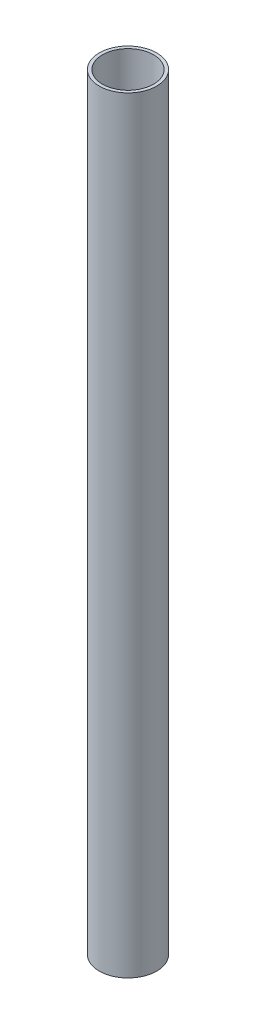
ISO-10303-21;
HEADER;
FILE_DESCRIPTION(('STEP AP214'),'2;1');
FILE_NAME('part.step','',(''),(''),'','','');
FILE_SCHEMA(('AUTOMOTIVE_DESIGN { 1 0 10303 214 1 1 1 1 }'));
ENDSEC;
DATA;
#1=APPLICATION_CONTEXT('core data for automotive mechanical design processes');
#2=APPLICATION_PROTOCOL_DEFINITION('international standard','automotive_design',2000,#1);
#3=PRODUCT_CONTEXT('',#1,'mechanical');
#4=PRODUCT('Part','Part','',(#3));
#5=PRODUCT_RELATED_PRODUCT_CATEGORY('part','',(#4));
#6=PRODUCT_DEFINITION_FORMATION('','',#4);
#7=PRODUCT_DEFINITION_CONTEXT('part definition',#1,'design');
#8=PRODUCT_DEFINITION('design','',#6,#7);
#9=PRODUCT_DEFINITION_SHAPE('','',#8);
#10=(LENGTH_UNIT() NAMED_UNIT(*) SI_UNIT(.MILLI.,.METRE.));
#11=(NAMED_UNIT(*) PLANE_ANGLE_UNIT() SI_UNIT($,.RADIAN.));
#12=(NAMED_UNIT(*) SI_UNIT($,.STERADIAN.) SOLID_ANGLE_UNIT());
#13=UNCERTAINTY_MEASURE_WITH_UNIT(LENGTH_MEASURE(1.E-05),#10,'distance_accuracy_value','');
#14=(GEOMETRIC_REPRESENTATION_CONTEXT(3) GLOBAL_UNCERTAINTY_ASSIGNED_CONTEXT((#13)) GLOBAL_UNIT_ASSIGNED_CONTEXT((#10,
#11,#12)) REPRESENTATION_CONTEXT('',''));
#15=CARTESIAN_POINT('',(0.,0.,0.));
#16=DIRECTION('',(0.,0.,1.));
#17=DIRECTION('',(1.,0.,0.));
#18=AXIS2_PLACEMENT_3D('',#15,#16,#17);
#19=CARTESIAN_POINT('',(0.,1524.,0.));
#20=DIRECTION('',(0.,1.,0.));
#21=DIRECTION('',(0.,0.,1.));
#22=AXIS2_PLACEMENT_3D('',#19,#20,#21);
#23=PLANE('',#22);
#24=CARTESIAN_POINT('',(0.,1524.,0.));
#25=DIRECTION('',(0.,1.,0.));
#26=DIRECTION('',(0.,0.,1.));
#27=AXIS2_PLACEMENT_3D('',#24,#25,#26);
#28=CIRCLE('',#27,57.15);
#29=CARTESIAN_POINT('',(0.,1524.,57.15));
#30=VERTEX_POINT('',#29);
#31=EDGE_CURVE('E10',#30,#30,#28,.T.);
#32=ORIENTED_EDGE('',*,*,#31,.T.);
#33=EDGE_LOOP('',(#32));
#34=FACE_BOUND('',#33,.T.);
#35=CARTESIAN_POINT('',(0.,1524.,0.));
#36=DIRECTION('',(0.,1.,0.));
#37=DIRECTION('',(0.,0.,1.));
#38=AXIS2_PLACEMENT_3D('',#35,#36,#37);
#39=CIRCLE('',#38,50.8);
#40=CARTESIAN_POINT('',(0.,1524.,50.8));
#41=VERTEX_POINT('',#40);
#42=EDGE_CURVE('E50',#41,#41,#39,.T.);
#43=ORIENTED_EDGE('',*,*,#42,.F.);
#44=EDGE_LOOP('',(#43));
#45=FACE_BOUND('',#44,.T.);
#46=ADVANCED_FACE('F37',(#34,#45),#23,.T.);
#47=CARTESIAN_POINT('',(0.,0.,0.));
#48=DIRECTION('',(0.,1.,0.));
#49=DIRECTION('',(0.,0.,1.));
#50=AXIS2_PLACEMENT_3D('',#47,#48,#49);
#51=PLANE('',#50);
#52=CARTESIAN_POINT('',(0.,0.,0.));
#53=DIRECTION('',(0.,1.,0.));
#54=DIRECTION('',(0.,0.,1.));
#55=AXIS2_PLACEMENT_3D('',#52,#53,#54);
#56=CIRCLE('',#55,57.15);
#57=CARTESIAN_POINT('',(0.,0.,57.15));
#58=VERTEX_POINT('',#57);
#59=EDGE_CURVE('E41',#58,#58,#56,.T.);
#60=ORIENTED_EDGE('',*,*,#59,.F.);
#61=EDGE_LOOP('',(#60));
#62=FACE_BOUND('',#61,.T.);
#63=CARTESIAN_POINT('',(0.,0.,0.));
#64=DIRECTION('',(0.,1.,0.));
#65=DIRECTION('',(0.,0.,1.));
#66=AXIS2_PLACEMENT_3D('',#63,#64,#65);
#67=CIRCLE('',#66,50.8);
#68=CARTESIAN_POINT('',(0.,0.,50.8));
#69=VERTEX_POINT('',#68);
#70=EDGE_CURVE('E52',#69,#69,#67,.T.);
#71=ORIENTED_EDGE('',*,*,#70,.T.);
#72=EDGE_LOOP('',(#71));
#73=FACE_BOUND('',#72,.T.);
#74=ADVANCED_FACE('F64',(#62,#73),#51,.F.);
#75=CARTESIAN_POINT('',(0.,1524.,0.));
#76=DIRECTION('',(0.,-1.,0.));
#77=DIRECTION('',(0.,0.,-1.));
#78=AXIS2_PLACEMENT_3D('',#75,#76,#77);
#79=CYLINDRICAL_SURFACE('',#78,57.15);
#80=ORIENTED_EDGE('',*,*,#31,.F.);
#81=EDGE_LOOP('',(#80));
#82=FACE_BOUND('',#81,.T.);
#83=ORIENTED_EDGE('',*,*,#59,.T.);
#84=EDGE_LOOP('',(#83));
#85=FACE_BOUND('',#84,.T.);
#86=ADVANCED_FACE('F39',(#82,#85),#79,.T.);
#87=CARTESIAN_POINT('',(0.,1524.,0.));
#88=DIRECTION('',(0.,-1.,0.));
#89=DIRECTION('',(0.,0.,-1.));
#90=AXIS2_PLACEMENT_3D('',#87,#88,#89);
#91=CYLINDRICAL_SURFACE('',#90,50.8);
#92=ORIENTED_EDGE('',*,*,#42,.T.);
#93=EDGE_LOOP('',(#92));
#94=FACE_BOUND('',#93,.T.);
#95=ORIENTED_EDGE('',*,*,#70,.F.);
#96=EDGE_LOOP('',(#95));
#97=FACE_BOUND('',#96,.T.);
#98=ADVANCED_FACE('F60',(#94,#97),#91,.F.);
#99=CLOSED_SHELL('',(#46,#74,#86,#98));
#100=MANIFOLD_SOLID_BREP('B2',#99);
#101=ADVANCED_BREP_SHAPE_REPRESENTATION('',(#18,#100),#14);
#102=SHAPE_DEFINITION_REPRESENTATION(#9,#101);
ENDSEC;
END-ISO-10303-21;
